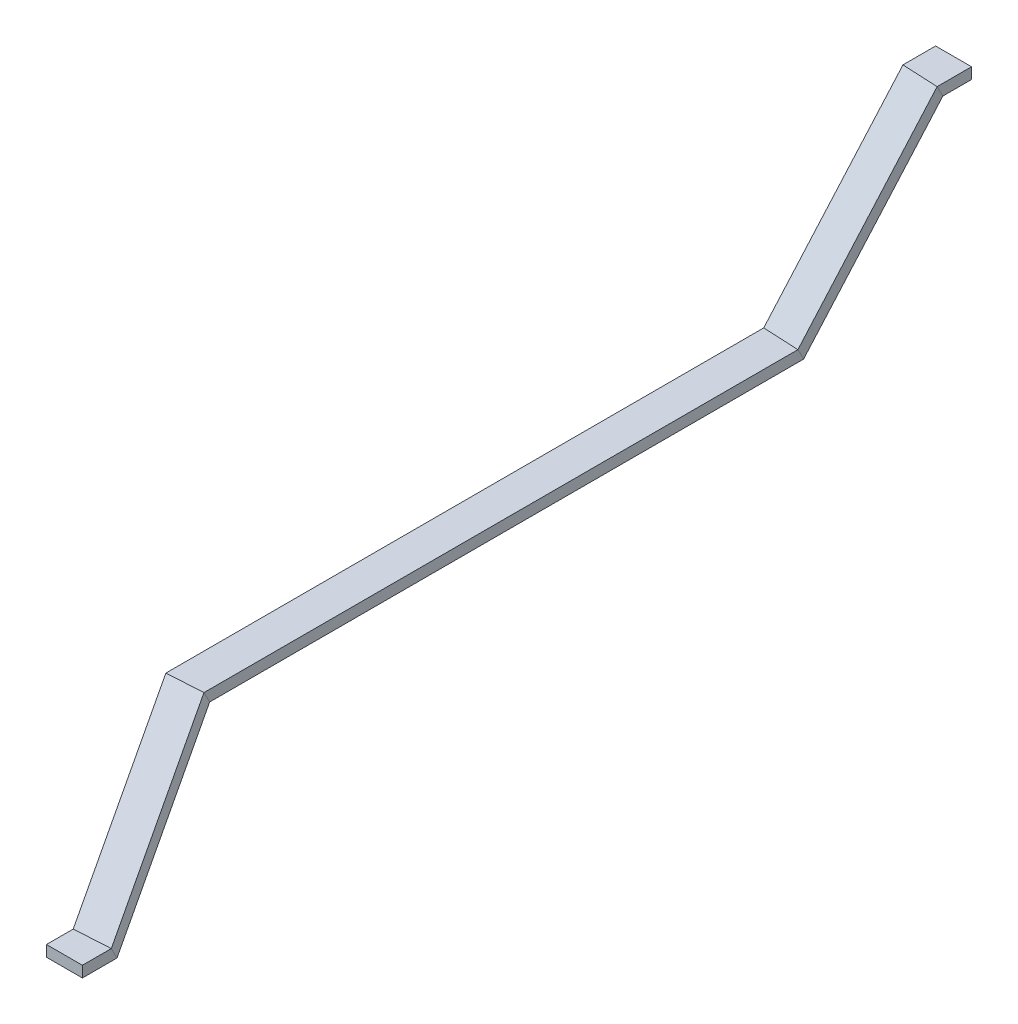
ISO-10303-21;
HEADER;
FILE_DESCRIPTION(('STEP AP214'),'2;1');
FILE_NAME('part.step','',(''),(''),'','','');
FILE_SCHEMA(('AUTOMOTIVE_DESIGN { 1 0 10303 214 1 1 1 1 }'));
ENDSEC;
DATA;
#1=APPLICATION_CONTEXT('core data for automotive mechanical design processes');
#2=APPLICATION_PROTOCOL_DEFINITION('international standard','automotive_design',2000,#1);
#3=PRODUCT_CONTEXT('',#1,'mechanical');
#4=PRODUCT('Part','Part','',(#3));
#5=PRODUCT_RELATED_PRODUCT_CATEGORY('part','',(#4));
#6=PRODUCT_DEFINITION_FORMATION('','',#4);
#7=PRODUCT_DEFINITION_CONTEXT('part definition',#1,'design');
#8=PRODUCT_DEFINITION('design','',#6,#7);
#9=PRODUCT_DEFINITION_SHAPE('','',#8);
#10=(LENGTH_UNIT() NAMED_UNIT(*) SI_UNIT(.MILLI.,.METRE.));
#11=(NAMED_UNIT(*) PLANE_ANGLE_UNIT() SI_UNIT($,.RADIAN.));
#12=(NAMED_UNIT(*) SI_UNIT($,.STERADIAN.) SOLID_ANGLE_UNIT());
#13=UNCERTAINTY_MEASURE_WITH_UNIT(LENGTH_MEASURE(1.E-05),#10,'distance_accuracy_value','');
#14=(GEOMETRIC_REPRESENTATION_CONTEXT(3) GLOBAL_UNCERTAINTY_ASSIGNED_CONTEXT((#13)) GLOBAL_UNIT_ASSIGNED_CONTEXT((#10,
#11,#12)) REPRESENTATION_CONTEXT('',''));
#15=CARTESIAN_POINT('',(0.,0.,0.));
#16=DIRECTION('',(0.,0.,1.));
#17=DIRECTION('',(1.,0.,0.));
#18=AXIS2_PLACEMENT_3D('',#15,#16,#17);
#19=CARTESIAN_POINT('',(3287.28752773958,-318.127166096438,1373.88211069601));
#20=DIRECTION('',(0.,1.,0.));
#21=DIRECTION('',(0.,0.,1.));
#22=AXIS2_PLACEMENT_3D('',#19,#20,#21);
#23=PLANE('',#22);
#24=DIRECTION('',(1.,0.,0.));
#25=VECTOR('',#24,1.);
#26=CARTESIAN_POINT('',(3287.28752773958,-318.127166096438,1441.62425209192));
#27=LINE('',#26,#25);
#28=CARTESIAN_POINT('',(3216.05681875516,-318.127166096439,1441.62425209192));
#29=VERTEX_POINT('',#28);
#30=CARTESIAN_POINT('',(3286.30681875516,-318.127166096439,1441.62425209192));
#31=VERTEX_POINT('',#30);
#32=EDGE_CURVE('E49',#29,#31,#27,.T.);
#33=ORIENTED_EDGE('',*,*,#32,.F.);
#34=DIRECTION('',(0.,0.,1.));
#35=VECTOR('',#34,1.);
#36=CARTESIAN_POINT('',(3216.05681875516,-318.127166096439,1378.13785387575));
#37=LINE('',#36,#35);
#38=CARTESIAN_POINT('',(3216.05681875516,-318.127166096439,1378.13785387575));
#39=VERTEX_POINT('',#38);
#40=EDGE_CURVE('E214',#39,#29,#37,.T.);
#41=ORIENTED_EDGE('',*,*,#40,.F.);
#42=DIRECTION('',(-0.998219977436996,0.,0.0596395560486688));
#43=VECTOR('',#42,1.);
#44=CARTESIAN_POINT('',(3287.28752773958,-318.127166096438,1373.88211069601));
#45=LINE('',#44,#43);
#46=CARTESIAN_POINT('',(3286.30681875516,-318.127166096439,1373.94070404193));
#47=VERTEX_POINT('',#46);
#48=EDGE_CURVE('E210',#47,#39,#45,.T.);
#49=ORIENTED_EDGE('',*,*,#48,.F.);
#50=DIRECTION('',(0.,0.,1.));
#51=VECTOR('',#50,1.);
#52=CARTESIAN_POINT('',(3286.30681875516,-318.127166096439,1373.94070404193));
#53=LINE('',#52,#51);
#54=EDGE_CURVE('E223',#47,#31,#53,.T.);
#55=ORIENTED_EDGE('',*,*,#54,.T.);
#56=EDGE_LOOP('',(#33,#41,#49,#55));
#57=FACE_BOUND('',#56,.T.);
#58=ADVANCED_FACE('F40',(#57),#23,.F.);
#59=CARTESIAN_POINT('',(3216.05681875516,-419.788403178154,1325.56606889643));
#60=DIRECTION('',(1.,0.,0.));
#61=DIRECTION('',(0.,1.,0.));
#62=AXIS2_PLACEMENT_3D('',#59,#60,#61);
#63=PLANE('',#62);
#64=DIRECTION('',(0.,-1.,0.));
#65=VECTOR('',#64,1.);
#66=CARTESIAN_POINT('',(3216.05681875516,-419.788403178154,1441.62425209192));
#67=LINE('',#66,#65);
#68=CARTESIAN_POINT('',(3216.05681875516,-296.527166096439,1441.62425209192));
#69=VERTEX_POINT('',#68);
#70=EDGE_CURVE('E229',#69,#29,#67,.T.);
#71=ORIENTED_EDGE('',*,*,#70,.F.);
#72=DIRECTION('',(0.,0.,1.));
#73=VECTOR('',#72,1.);
#74=CARTESIAN_POINT('',(3216.05681875516,-296.527166096439,1389.30780014191));
#75=LINE('',#74,#73);
#76=CARTESIAN_POINT('',(3216.05681875516,-296.527166096439,1389.30780014191));
#77=VERTEX_POINT('',#76);
#78=EDGE_CURVE('E217',#77,#69,#75,.T.);
#79=ORIENTED_EDGE('',*,*,#78,.F.);
#80=DIRECTION('',(0.,0.888259047127896,0.459342862353866));
#81=VECTOR('',#80,1.);
#82=CARTESIAN_POINT('',(3216.05681875516,-419.788403178154,1325.56606889643));
#83=LINE('',#82,#81);
#84=EDGE_CURVE('E213',#39,#77,#83,.T.);
#85=ORIENTED_EDGE('',*,*,#84,.F.);
#86=ORIENTED_EDGE('',*,*,#40,.T.);
#87=EDGE_LOOP('',(#71,#79,#85,#86));
#88=FACE_BOUND('',#87,.T.);
#89=ADVANCED_FACE('F297',(#88),#63,.F.);
#90=CARTESIAN_POINT('',(3286.7450773273,-296.527166096439,1385.08446615302));
#91=DIRECTION('',(0.,-1.,0.));
#92=DIRECTION('',(0.,0.,-1.));
#93=AXIS2_PLACEMENT_3D('',#90,#91,#92);
#94=PLANE('',#93);
#95=DIRECTION('',(-1.,0.,0.));
#96=VECTOR('',#95,1.);
#97=CARTESIAN_POINT('',(3286.7450773273,-296.527166096439,1441.62425209192));
#98=LINE('',#97,#96);
#99=CARTESIAN_POINT('',(3286.30681875516,-296.527166096439,1441.62425209192));
#100=VERTEX_POINT('',#99);
#101=EDGE_CURVE('E225',#100,#69,#98,.T.);
#102=ORIENTED_EDGE('',*,*,#101,.F.);
#103=DIRECTION('',(0.,0.,1.));
#104=VECTOR('',#103,1.);
#105=CARTESIAN_POINT('',(3286.30681875516,-296.527166096439,1385.11065030808));
#106=LINE('',#105,#104);
#107=CARTESIAN_POINT('',(3286.30681875516,-296.527166096439,1385.11065030808));
#108=VERTEX_POINT('',#107);
#109=EDGE_CURVE('E221',#108,#100,#106,.T.);
#110=ORIENTED_EDGE('',*,*,#109,.F.);
#111=DIRECTION('',(0.998219977436996,0.,-0.0596395560486688));
#112=VECTOR('',#111,1.);
#113=CARTESIAN_POINT('',(3286.7450773273,-296.527166096439,1385.08446615302));
#114=LINE('',#113,#112);
#115=EDGE_CURVE('E237',#77,#108,#114,.T.);
#116=ORIENTED_EDGE('',*,*,#115,.F.);
#117=ORIENTED_EDGE('',*,*,#78,.T.);
#118=EDGE_LOOP('',(#102,#110,#116,#117));
#119=FACE_BOUND('',#118,.T.);
#120=ADVANCED_FACE('F300',(#119),#94,.F.);
#121=CARTESIAN_POINT('',(3286.30681875516,-418.078354921317,1322.25323143026));
#122=DIRECTION('',(-1.,0.,0.));
#123=DIRECTION('',(0.,-1.,0.));
#124=AXIS2_PLACEMENT_3D('',#121,#122,#123);
#125=PLANE('',#124);
#126=DIRECTION('',(0.,1.,0.));
#127=VECTOR('',#126,1.);
#128=CARTESIAN_POINT('',(3286.30681875516,-418.078354921317,1441.62425209192));
#129=LINE('',#128,#127);
#130=EDGE_CURVE('E12',#31,#100,#129,.T.);
#131=ORIENTED_EDGE('',*,*,#130,.F.);
#132=ORIENTED_EDGE('',*,*,#54,.F.);
#133=DIRECTION('',(0.,-0.888259047127896,-0.459342862353866));
#134=VECTOR('',#133,1.);
#135=CARTESIAN_POINT('',(3286.30681875516,-418.078354921317,1322.25323143026));
#136=LINE('',#135,#134);
#137=EDGE_CURVE('E218',#108,#47,#136,.T.);
#138=ORIENTED_EDGE('',*,*,#137,.F.);
#139=ORIENTED_EDGE('',*,*,#109,.T.);
#140=EDGE_LOOP('',(#131,#132,#138,#139));
#141=FACE_BOUND('',#140,.T.);
#142=ADVANCED_FACE('F42',(#141),#125,.F.);
#143=CARTESIAN_POINT('',(3180.55,-266.557599473965,1029.25440533547));
#144=DIRECTION('',(-0.994383003760604,-0.0486175781652329,0.0940147484461121));
#145=DIRECTION('',(0.0941260556739342,0.,0.995560287297192));
#146=AXIS2_PLACEMENT_3D('',#143,#144,#145);
#147=PLANE('',#146);
#148=DIRECTION('',(0.0940147484461121,-0.813739085172541,0.57357643635105));
#149=VECTOR('',#148,1.);
#150=CARTESIAN_POINT('',(3180.55,-10.7999999999998,1161.51360178384));
#151=LINE('',#150,#149);
#152=CARTESIAN_POINT('',(3180.55,-10.7999999999998,1161.51360178384));
#153=VERTEX_POINT('',#152);
#154=EDGE_CURVE('E207',#153,#39,#151,.T.);
#155=ORIENTED_EDGE('',*,*,#154,.T.);
#156=ORIENTED_EDGE('',*,*,#84,.T.);
#157=DIRECTION('',(0.0940147484461121,-0.813739085172541,0.57357643635105));
#158=VECTOR('',#157,1.);
#159=CARTESIAN_POINT('',(3180.55,10.8,1172.68354804999));
#160=LINE('',#159,#158);
#161=CARTESIAN_POINT('',(3180.55,10.8,1172.68354804999));
#162=VERTEX_POINT('',#161);
#163=EDGE_CURVE('E197',#162,#77,#160,.T.);
#164=ORIENTED_EDGE('',*,*,#163,.F.);
#165=DIRECTION('',(0.,-0.888259047127896,-0.459342862353866));
#166=VECTOR('',#165,1.);
#167=CARTESIAN_POINT('',(3180.55,-266.557599473965,1029.25440533547));
#168=LINE('',#167,#166);
#169=EDGE_CURVE('E198',#162,#153,#168,.T.);
#170=ORIENTED_EDGE('',*,*,#169,.T.);
#171=EDGE_LOOP('',(#155,#156,#164,#170));
#172=FACE_BOUND('',#171,.T.);
#173=ADVANCED_FACE('F294',(#172),#147,.T.);
#174=CARTESIAN_POINT('',(3273.72240650639,10.8,1167.11687829219));
#175=DIRECTION('',(0.0486175781652329,0.579193432590446,0.813739085172541));
#176=DIRECTION('',(0.,-0.814702498288442,0.579879159206961));
#177=AXIS2_PLACEMENT_3D('',#174,#175,#176);
#178=PLANE('',#177);
#179=ORIENTED_EDGE('',*,*,#163,.T.);
#180=ORIENTED_EDGE('',*,*,#115,.T.);
#181=DIRECTION('',(0.0940147484461121,-0.813739085172541,0.57357643635105));
#182=VECTOR('',#181,1.);
#183=CARTESIAN_POINT('',(3250.8,10.8,1168.48639821617));
#184=LINE('',#183,#182);
#185=CARTESIAN_POINT('',(3250.8,10.8,1168.48639821617));
#186=VERTEX_POINT('',#185);
#187=EDGE_CURVE('E201',#186,#108,#184,.T.);
#188=ORIENTED_EDGE('',*,*,#187,.F.);
#189=DIRECTION('',(-0.998219977436996,0.,0.0596395560486688));
#190=VECTOR('',#189,1.);
#191=CARTESIAN_POINT('',(3273.72240650639,10.8,1167.11687829219));
#192=LINE('',#191,#190);
#193=EDGE_CURVE('E244',#186,#162,#192,.T.);
#194=ORIENTED_EDGE('',*,*,#193,.T.);
#195=EDGE_LOOP('',(#179,#180,#188,#194));
#196=FACE_BOUND('',#195,.T.);
#197=ADVANCED_FACE('F292',(#196),#178,.T.);
#198=CARTESIAN_POINT('',(3250.8,-264.847551217128,1025.94156786931));
#199=DIRECTION('',(0.994383003760604,0.0486175781652329,-0.0940147484461121));
#200=DIRECTION('',(-0.0941260556739342,0.,-0.995560287297192));
#201=AXIS2_PLACEMENT_3D('',#198,#199,#200);
#202=PLANE('',#201);
#203=ORIENTED_EDGE('',*,*,#187,.T.);
#204=ORIENTED_EDGE('',*,*,#137,.T.);
#205=DIRECTION('',(0.0940147484461121,-0.813739085172541,0.57357643635105));
#206=VECTOR('',#205,1.);
#207=CARTESIAN_POINT('',(3250.8,-10.7999999999998,1157.31645195001));
#208=LINE('',#207,#206);
#209=CARTESIAN_POINT('',(3250.8,-10.7999999999998,1157.31645195001));
#210=VERTEX_POINT('',#209);
#211=EDGE_CURVE('E204',#210,#47,#208,.T.);
#212=ORIENTED_EDGE('',*,*,#211,.F.);
#213=DIRECTION('',(0.,0.888259047127896,0.459342862353866));
#214=VECTOR('',#213,1.);
#215=CARTESIAN_POINT('',(3250.8,-264.847551217128,1025.94156786931));
#216=LINE('',#215,#214);
#217=EDGE_CURVE('E193',#210,#186,#216,.T.);
#218=ORIENTED_EDGE('',*,*,#217,.T.);
#219=EDGE_LOOP('',(#203,#204,#212,#218));
#220=FACE_BOUND('',#219,.T.);
#221=ADVANCED_FACE('F288',(#220),#202,.T.);
#222=CARTESIAN_POINT('',(3274.26485691867,-10.7999999999998,1155.91452283518));
#223=DIRECTION('',(-0.0486175781652329,-0.579193432590446,-0.813739085172541));
#224=DIRECTION('',(0.,0.814702498288442,-0.579879159206961));
#225=AXIS2_PLACEMENT_3D('',#222,#223,#224);
#226=PLANE('',#225);
#227=ORIENTED_EDGE('',*,*,#211,.T.);
#228=ORIENTED_EDGE('',*,*,#48,.T.);
#229=ORIENTED_EDGE('',*,*,#154,.F.);
#230=DIRECTION('',(0.998219977436996,0.,-0.0596395560486688));
#231=VECTOR('',#230,1.);
#232=CARTESIAN_POINT('',(3274.26485691867,-10.7999999999998,1155.91452283518));
#233=LINE('',#232,#231);
#234=EDGE_CURVE('E194',#153,#210,#233,.T.);
#235=ORIENTED_EDGE('',*,*,#234,.T.);
#236=EDGE_LOOP('',(#227,#228,#229,#235));
#237=FACE_BOUND('',#236,.T.);
#238=ADVANCED_FACE('F282',(#237),#226,.T.);
#239=CARTESIAN_POINT('',(3180.55,210.236545332705,107.248758895565));
#240=DIRECTION('',(1.,0.,0.));
#241=DIRECTION('',(0.,1.,0.));
#242=AXIS2_PLACEMENT_3D('',#239,#240,#241);
#243=PLANE('',#242);
#244=ORIENTED_EDGE('',*,*,#169,.F.);
#245=DIRECTION('',(0.,0.,1.));
#246=VECTOR('',#245,1.);
#247=CARTESIAN_POINT('',(3180.55,10.8000000000001,3.88496874424613));
#248=LINE('',#247,#246);
#249=CARTESIAN_POINT('',(3180.55,10.8000000000001,3.88496874424613));
#250=VERTEX_POINT('',#249);
#251=EDGE_CURVE('E180',#250,#162,#248,.T.);
#252=ORIENTED_EDGE('',*,*,#251,.F.);
#253=DIRECTION('',(0.,0.887841385900377,0.46014962075666));
#254=VECTOR('',#253,1.);
#255=CARTESIAN_POINT('',(3180.55,210.236545332705,107.248758895565));
#256=LINE('',#255,#254);
#257=CARTESIAN_POINT('',(3180.55,-10.7999999999999,-7.30985948316778));
#258=VERTEX_POINT('',#257);
#259=EDGE_CURVE('E176',#258,#250,#256,.T.);
#260=ORIENTED_EDGE('',*,*,#259,.F.);
#261=DIRECTION('',(0.,0.,1.));
#262=VECTOR('',#261,1.);
#263=CARTESIAN_POINT('',(3180.55,-10.7999999999999,-7.30985948316778));
#264=LINE('',#263,#262);
#265=EDGE_CURVE('E190',#258,#153,#264,.T.);
#266=ORIENTED_EDGE('',*,*,#265,.T.);
#267=EDGE_LOOP('',(#244,#252,#260,#266));
#268=FACE_BOUND('',#267,.T.);
#269=ADVANCED_FACE('F272',(#268),#243,.F.);
#270=CARTESIAN_POINT('',(3204.29322213864,10.8,5.0425195145638));
#271=DIRECTION('',(0.,-1.,0.));
#272=DIRECTION('',(1.,0.,0.));
#273=AXIS2_PLACEMENT_3D('',#270,#271,#272);
#274=PLANE('',#273);
#275=ORIENTED_EDGE('',*,*,#193,.F.);
#276=DIRECTION('',(0.,0.,1.));
#277=VECTOR('',#276,1.);
#278=CARTESIAN_POINT('',(3250.8,10.8,7.30985948316865));
#279=LINE('',#278,#277);
#280=CARTESIAN_POINT('',(3250.8,10.8,7.30985948316865));
#281=VERTEX_POINT('',#280);
#282=EDGE_CURVE('E183',#281,#186,#279,.T.);
#283=ORIENTED_EDGE('',*,*,#282,.F.);
#284=DIRECTION('',(0.998813692041989,0.,0.0486950571357103));
#285=VECTOR('',#284,1.);
#286=CARTESIAN_POINT('',(3204.29322213864,10.8,5.0425195145638));
#287=LINE('',#286,#285);
#288=EDGE_CURVE('E179',#250,#281,#287,.T.);
#289=ORIENTED_EDGE('',*,*,#288,.F.);
#290=ORIENTED_EDGE('',*,*,#251,.T.);
#291=EDGE_LOOP('',(#275,#283,#289,#290));
#292=FACE_BOUND('',#291,.T.);
#293=ADVANCED_FACE('F290',(#292),#274,.F.);
#294=CARTESIAN_POINT('',(3250.8,208.837340891439,109.948471237496));
#295=DIRECTION('',(-1.,0.,0.));
#296=DIRECTION('',(0.,-1.,0.));
#297=AXIS2_PLACEMENT_3D('',#294,#295,#296);
#298=PLANE('',#297);
#299=ORIENTED_EDGE('',*,*,#217,.F.);
#300=DIRECTION('',(0.,0.,1.));
#301=VECTOR('',#300,1.);
#302=CARTESIAN_POINT('',(3250.8,-10.7999999999998,-3.88496874424529));
#303=LINE('',#302,#301);
#304=CARTESIAN_POINT('',(3250.8,-10.7999999999998,-3.88496874424529));
#305=VERTEX_POINT('',#304);
#306=EDGE_CURVE('E187',#305,#210,#303,.T.);
#307=ORIENTED_EDGE('',*,*,#306,.F.);
#308=DIRECTION('',(0.,-0.887841385900377,-0.46014962075666));
#309=VECTOR('',#308,1.);
#310=CARTESIAN_POINT('',(3250.8,208.837340891439,109.948471237496));
#311=LINE('',#310,#309);
#312=EDGE_CURVE('E251',#281,#305,#311,.T.);
#313=ORIENTED_EDGE('',*,*,#312,.F.);
#314=ORIENTED_EDGE('',*,*,#282,.T.);
#315=EDGE_LOOP('',(#299,#307,#313,#314));
#316=FACE_BOUND('',#315,.T.);
#317=ADVANCED_FACE('F284',(#316),#298,.F.);
#318=CARTESIAN_POINT('',(3204.83770824342,-10.7999999999998,-6.12576343999993));
#319=DIRECTION('',(0.,1.,0.));
#320=DIRECTION('',(-1.,0.,0.));
#321=AXIS2_PLACEMENT_3D('',#318,#319,#320);
#322=PLANE('',#321);
#323=ORIENTED_EDGE('',*,*,#234,.F.);
#324=ORIENTED_EDGE('',*,*,#265,.F.);
#325=DIRECTION('',(-0.998813692041989,0.,-0.0486950571357103));
#326=VECTOR('',#325,1.);
#327=CARTESIAN_POINT('',(3204.83770824342,-10.7999999999998,-6.12576343999993));
#328=LINE('',#327,#326);
#329=EDGE_CURVE('E184',#305,#258,#328,.T.);
#330=ORIENTED_EDGE('',*,*,#329,.F.);
#331=ORIENTED_EDGE('',*,*,#306,.T.);
#332=EDGE_LOOP('',(#323,#324,#330,#331));
#333=FACE_BOUND('',#332,.T.);
#334=ADVANCED_FACE('F279',(#333),#322,.F.);
#335=CARTESIAN_POINT('',(3216.04596948215,352.155989281594,-236.025171053897));
#336=DIRECTION('',(-0.0397605075125552,0.577316582980891,0.81555175498408));
#337=DIRECTION('',(0.,-0.816197172391179,0.577773464067574));
#338=AXIS2_PLACEMENT_3D('',#335,#336,#337);
#339=PLANE('',#338);
#340=DIRECTION('',(-0.0767164037558069,-0.81555175498408,0.573576436351044));
#341=VECTOR('',#340,1.);
#342=CARTESIAN_POINT('',(3212.66029065679,352.155989281594,-236.190232691675));
#343=LINE('',#342,#341);
#344=CARTESIAN_POINT('',(3212.66029065679,352.155989281594,-236.190232691675));
#345=VERTEX_POINT('',#344);
#346=EDGE_CURVE('E173',#345,#250,#343,.T.);
#347=ORIENTED_EDGE('',*,*,#346,.T.);
#348=ORIENTED_EDGE('',*,*,#288,.T.);
#349=DIRECTION('',(-0.0767164037558069,-0.81555175498408,0.573576436351044));
#350=VECTOR('',#349,1.);
#351=CARTESIAN_POINT('',(3282.91029065679,352.155989281594,-232.765341952753));
#352=LINE('',#351,#350);
#353=CARTESIAN_POINT('',(3282.91029065679,352.155989281594,-232.765341952753));
#354=VERTEX_POINT('',#353);
#355=EDGE_CURVE('E164',#354,#281,#352,.T.);
#356=ORIENTED_EDGE('',*,*,#355,.F.);
#357=DIRECTION('',(-0.998813692041989,0.,-0.0486950571357103));
#358=VECTOR('',#357,1.);
#359=CARTESIAN_POINT('',(3216.04596948215,352.155989281594,-236.025171053897));
#360=LINE('',#359,#358);
#361=EDGE_CURVE('E151',#354,#345,#360,.T.);
#362=ORIENTED_EDGE('',*,*,#361,.T.);
#363=EDGE_LOOP('',(#347,#348,#356,#362));
#364=FACE_BOUND('',#363,.T.);
#365=ADVANCED_FACE('F263',(#364),#339,.T.);
#366=CARTESIAN_POINT('',(3282.91029065679,379.195557160013,-218.751299464679));
#367=DIRECTION('',(0.996259853370154,-0.0397605075125552,0.0767164037558069));
#368=DIRECTION('',(0.076777116153385,0.,-0.997048280894747));
#369=AXIS2_PLACEMENT_3D('',#366,#367,#368);
#370=PLANE('',#369);
#371=ORIENTED_EDGE('',*,*,#355,.T.);
#372=ORIENTED_EDGE('',*,*,#312,.T.);
#373=DIRECTION('',(-0.0767164037558069,-0.81555175498408,0.573576436351044));
#374=VECTOR('',#373,1.);
#375=CARTESIAN_POINT('',(3282.91029065679,330.555989281594,-243.960170180167));
#376=LINE('',#375,#374);
#377=CARTESIAN_POINT('',(3282.91029065679,330.555989281594,-243.960170180167));
#378=VERTEX_POINT('',#377);
#379=EDGE_CURVE('E167',#378,#305,#376,.T.);
#380=ORIENTED_EDGE('',*,*,#379,.F.);
#381=DIRECTION('',(0.,0.887841385900377,0.46014962075666));
#382=VECTOR('',#381,1.);
#383=CARTESIAN_POINT('',(3282.91029065679,379.195557160013,-218.751299464679));
#384=LINE('',#383,#382);
#385=EDGE_CURVE('E256',#378,#354,#384,.T.);
#386=ORIENTED_EDGE('',*,*,#385,.T.);
#387=EDGE_LOOP('',(#371,#372,#380,#386));
#388=FACE_BOUND('',#387,.T.);
#389=ADVANCED_FACE('F353',(#388),#370,.T.);
#390=CARTESIAN_POINT('',(3216.59045558693,330.555989281594,-247.19345400846));
#391=DIRECTION('',(0.0397605075125552,-0.577316582980891,-0.81555175498408));
#392=DIRECTION('',(0.,0.816197172391179,-0.577773464067574));
#393=AXIS2_PLACEMENT_3D('',#390,#391,#392);
#394=PLANE('',#393);
#395=ORIENTED_EDGE('',*,*,#379,.T.);
#396=ORIENTED_EDGE('',*,*,#329,.T.);
#397=DIRECTION('',(-0.0767164037558069,-0.81555175498408,0.573576436351044));
#398=VECTOR('',#397,1.);
#399=CARTESIAN_POINT('',(3212.66029065679,330.555989281594,-247.385060919089));
#400=LINE('',#399,#398);
#401=CARTESIAN_POINT('',(3212.66029065679,330.555989281594,-247.385060919089));
#402=VERTEX_POINT('',#401);
#403=EDGE_CURVE('E170',#402,#258,#400,.T.);
#404=ORIENTED_EDGE('',*,*,#403,.F.);
#405=DIRECTION('',(0.998813692041989,0.,0.0486950571357103));
#406=VECTOR('',#405,1.);
#407=CARTESIAN_POINT('',(3216.59045558693,330.555989281594,-247.19345400846));
#408=LINE('',#407,#406);
#409=EDGE_CURVE('E131',#402,#378,#408,.T.);
#410=ORIENTED_EDGE('',*,*,#409,.T.);
#411=EDGE_LOOP('',(#395,#396,#404,#410));
#412=FACE_BOUND('',#411,.T.);
#413=ADVANCED_FACE('F277',(#412),#394,.T.);
#414=CARTESIAN_POINT('',(3212.66029065679,380.594761601279,-221.45101180661));
#415=DIRECTION('',(-0.996259853370154,0.0397605075125552,-0.0767164037558069));
#416=DIRECTION('',(-0.076777116153385,0.,0.997048280894747));
#417=AXIS2_PLACEMENT_3D('',#414,#415,#416);
#418=PLANE('',#417);
#419=ORIENTED_EDGE('',*,*,#403,.T.);
#420=ORIENTED_EDGE('',*,*,#259,.T.);
#421=ORIENTED_EDGE('',*,*,#346,.F.);
#422=DIRECTION('',(0.,-0.887841385900377,-0.46014962075666));
#423=VECTOR('',#422,1.);
#424=CARTESIAN_POINT('',(3212.66029065679,380.594761601279,-221.45101180661));
#425=LINE('',#424,#423);
#426=EDGE_CURVE('E161',#345,#402,#425,.T.);
#427=ORIENTED_EDGE('',*,*,#426,.T.);
#428=EDGE_LOOP('',(#419,#420,#421,#427));
#429=FACE_BOUND('',#428,.T.);
#430=ADVANCED_FACE('F268',(#429),#418,.T.);
#431=CARTESIAN_POINT('',(3212.66029065679,352.155989281594,-166.57947026737));
#432=DIRECTION('',(0.,-1.,0.));
#433=DIRECTION('',(0.,0.,-1.));
#434=AXIS2_PLACEMENT_3D('',#431,#432,#433);
#435=PLANE('',#434);
#436=ORIENTED_EDGE('',*,*,#361,.F.);
#437=DIRECTION('',(0.,0.,-1.));
#438=VECTOR('',#437,1.);
#439=CARTESIAN_POINT('',(3282.91029065679,352.155989281594,-166.57947026737));
#440=LINE('',#439,#438);
#441=CARTESIAN_POINT('',(3282.91029065679,352.155989281594,-300.075201435921));
#442=VERTEX_POINT('',#441);
#443=EDGE_CURVE('E158',#354,#442,#440,.T.);
#444=ORIENTED_EDGE('',*,*,#443,.T.);
#445=DIRECTION('',(-1.,0.,0.));
#446=VECTOR('',#445,1.);
#447=CARTESIAN_POINT('',(3212.66029065679,352.155989281594,-300.075201435921));
#448=LINE('',#447,#446);
#449=CARTESIAN_POINT('',(3212.66029065679,352.155989281594,-300.075201435921));
#450=VERTEX_POINT('',#449);
#451=EDGE_CURVE('E155',#442,#450,#448,.T.);
#452=ORIENTED_EDGE('',*,*,#451,.T.);
#453=DIRECTION('',(0.,0.,-1.));
#454=VECTOR('',#453,1.);
#455=CARTESIAN_POINT('',(3212.66029065679,352.155989281594,-166.57947026737));
#456=LINE('',#455,#454);
#457=EDGE_CURVE('E147',#345,#450,#456,.T.);
#458=ORIENTED_EDGE('',*,*,#457,.F.);
#459=EDGE_LOOP('',(#436,#444,#452,#458));
#460=FACE_BOUND('',#459,.T.);
#461=ADVANCED_FACE('F266',(#460),#435,.F.);
#462=CARTESIAN_POINT('',(3282.91029065679,352.155989281594,-166.57947026737));
#463=DIRECTION('',(-1.,0.,0.));
#464=DIRECTION('',(0.,0.,1.));
#465=AXIS2_PLACEMENT_3D('',#462,#463,#464);
#466=PLANE('',#465);
#467=ORIENTED_EDGE('',*,*,#385,.F.);
#468=DIRECTION('',(0.,0.,-1.));
#469=VECTOR('',#468,1.);
#470=CARTESIAN_POINT('',(3282.91029065679,330.555989281594,-166.57947026737));
#471=LINE('',#470,#469);
#472=CARTESIAN_POINT('',(3282.91029065679,330.555989281594,-300.075201435921));
#473=VERTEX_POINT('',#472);
#474=EDGE_CURVE('E135',#378,#473,#471,.T.);
#475=ORIENTED_EDGE('',*,*,#474,.T.);
#476=DIRECTION('',(0.,1.,0.));
#477=VECTOR('',#476,1.);
#478=CARTESIAN_POINT('',(3282.91029065679,352.155989281594,-300.075201435921));
#479=LINE('',#478,#477);
#480=EDGE_CURVE('E143',#473,#442,#479,.T.);
#481=ORIENTED_EDGE('',*,*,#480,.T.);
#482=ORIENTED_EDGE('',*,*,#443,.F.);
#483=EDGE_LOOP('',(#467,#475,#481,#482));
#484=FACE_BOUND('',#483,.T.);
#485=ADVANCED_FACE('F368',(#484),#466,.F.);
#486=CARTESIAN_POINT('',(3212.66029065679,330.555989281594,-166.57947026737));
#487=DIRECTION('',(0.,1.,0.));
#488=DIRECTION('',(0.,0.,1.));
#489=AXIS2_PLACEMENT_3D('',#486,#487,#488);
#490=PLANE('',#489);
#491=ORIENTED_EDGE('',*,*,#409,.F.);
#492=DIRECTION('',(0.,0.,-1.));
#493=VECTOR('',#492,1.);
#494=CARTESIAN_POINT('',(3212.66029065679,330.555989281594,-166.57947026737));
#495=LINE('',#494,#493);
#496=CARTESIAN_POINT('',(3212.66029065679,330.555989281594,-300.075201435921));
#497=VERTEX_POINT('',#496);
#498=EDGE_CURVE('E124',#402,#497,#495,.T.);
#499=ORIENTED_EDGE('',*,*,#498,.T.);
#500=DIRECTION('',(1.,0.,0.));
#501=VECTOR('',#500,1.);
#502=CARTESIAN_POINT('',(3212.66029065679,330.555989281594,-300.075201435921));
#503=LINE('',#502,#501);
#504=EDGE_CURVE('E128',#497,#473,#503,.T.);
#505=ORIENTED_EDGE('',*,*,#504,.T.);
#506=ORIENTED_EDGE('',*,*,#474,.F.);
#507=EDGE_LOOP('',(#491,#499,#505,#506));
#508=FACE_BOUND('',#507,.T.);
#509=ADVANCED_FACE('F126',(#508),#490,.F.);
#510=CARTESIAN_POINT('',(3212.66029065679,352.155989281594,-166.57947026737));
#511=DIRECTION('',(1.,0.,0.));
#512=DIRECTION('',(0.,0.,-1.));
#513=AXIS2_PLACEMENT_3D('',#510,#511,#512);
#514=PLANE('',#513);
#515=ORIENTED_EDGE('',*,*,#426,.F.);
#516=ORIENTED_EDGE('',*,*,#457,.T.);
#517=DIRECTION('',(0.,-1.,0.));
#518=VECTOR('',#517,1.);
#519=CARTESIAN_POINT('',(3212.66029065679,352.155989281594,-300.075201435921));
#520=LINE('',#519,#518);
#521=EDGE_CURVE('E141',#450,#497,#520,.T.);
#522=ORIENTED_EDGE('',*,*,#521,.T.);
#523=ORIENTED_EDGE('',*,*,#498,.F.);
#524=EDGE_LOOP('',(#515,#516,#522,#523));
#525=FACE_BOUND('',#524,.T.);
#526=ADVANCED_FACE('F145',(#525),#514,.F.);
#527=CARTESIAN_POINT('',(0.,0.,-300.075201435921));
#528=DIRECTION('',(0.,0.,1.));
#529=DIRECTION('',(1.,0.,0.));
#530=AXIS2_PLACEMENT_3D('',#527,#528,#529);
#531=PLANE('',#530);
#532=ORIENTED_EDGE('',*,*,#521,.F.);
#533=ORIENTED_EDGE('',*,*,#451,.F.);
#534=ORIENTED_EDGE('',*,*,#480,.F.);
#535=ORIENTED_EDGE('',*,*,#504,.F.);
#536=EDGE_LOOP('',(#532,#533,#534,#535));
#537=FACE_BOUND('',#536,.T.);
#538=ADVANCED_FACE('F139',(#537),#531,.F.);
#539=CARTESIAN_POINT('',(3251.18181875516,-307.327166096439,1441.62425209192));
#540=DIRECTION('',(0.,0.,1.));
#541=DIRECTION('',(1.,0.,0.));
#542=AXIS2_PLACEMENT_3D('',#539,#540,#541);
#543=PLANE('',#542);
#544=ORIENTED_EDGE('',*,*,#32,.T.);
#545=ORIENTED_EDGE('',*,*,#130,.T.);
#546=ORIENTED_EDGE('',*,*,#101,.T.);
#547=ORIENTED_EDGE('',*,*,#70,.T.);
#548=EDGE_LOOP('',(#544,#545,#546,#547));
#549=FACE_BOUND('',#548,.T.);
#550=ADVANCED_FACE('F303',(#549),#543,.T.);
#551=CLOSED_SHELL('',(#58,#89,#120,#142,#173,#197,#221,#238,#269,#293,#317,#334,#365,#389,#413,
#430,#461,#485,#509,#526,#538,#550));
#552=MANIFOLD_SOLID_BREP('B2',#551);
#553=ADVANCED_BREP_SHAPE_REPRESENTATION('',(#18,#552),#14);
#554=SHAPE_DEFINITION_REPRESENTATION(#9,#553);
ENDSEC;
END-ISO-10303-21;
